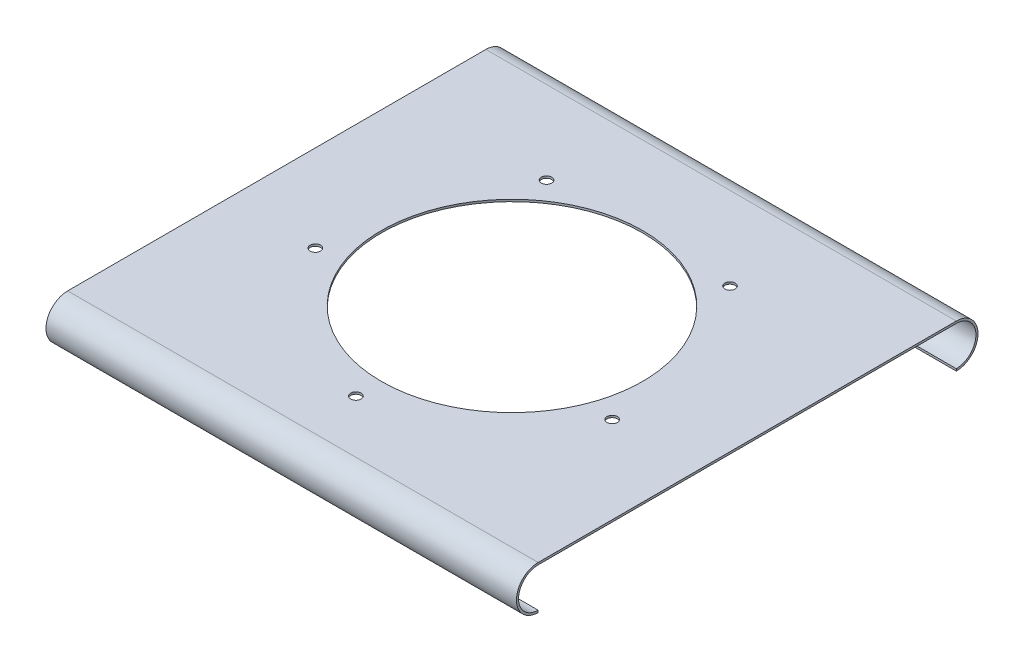
ISO-10303-21;
HEADER;
FILE_DESCRIPTION(('STEP AP214'),'2;1');
FILE_NAME('part.step','',(''),(''),'','','');
FILE_SCHEMA(('AUTOMOTIVE_DESIGN { 1 0 10303 214 1 1 1 1 }'));
ENDSEC;
DATA;
#1=APPLICATION_CONTEXT('core data for automotive mechanical design processes');
#2=APPLICATION_PROTOCOL_DEFINITION('international standard','automotive_design',2000,#1);
#3=PRODUCT_CONTEXT('',#1,'mechanical');
#4=PRODUCT('Part','Part','',(#3));
#5=PRODUCT_RELATED_PRODUCT_CATEGORY('part','',(#4));
#6=PRODUCT_DEFINITION_FORMATION('','',#4);
#7=PRODUCT_DEFINITION_CONTEXT('part definition',#1,'design');
#8=PRODUCT_DEFINITION('design','',#6,#7);
#9=PRODUCT_DEFINITION_SHAPE('','',#8);
#10=(LENGTH_UNIT() NAMED_UNIT(*) SI_UNIT(.MILLI.,.METRE.));
#11=(NAMED_UNIT(*) PLANE_ANGLE_UNIT() SI_UNIT($,.RADIAN.));
#12=(NAMED_UNIT(*) SI_UNIT($,.STERADIAN.) SOLID_ANGLE_UNIT());
#13=UNCERTAINTY_MEASURE_WITH_UNIT(LENGTH_MEASURE(1.E-05),#10,'distance_accuracy_value','');
#14=(GEOMETRIC_REPRESENTATION_CONTEXT(3) GLOBAL_UNCERTAINTY_ASSIGNED_CONTEXT((#13)) GLOBAL_UNIT_ASSIGNED_CONTEXT((#10,
#11,#12)) REPRESENTATION_CONTEXT('',''));
#15=CARTESIAN_POINT('',(0.,0.,0.));
#16=DIRECTION('',(0.,0.,1.));
#17=DIRECTION('',(1.,0.,0.));
#18=AXIS2_PLACEMENT_3D('',#15,#16,#17);
#19=CARTESIAN_POINT('',(114.3,228.6,101.6));
#20=DIRECTION('',(-1.,0.,0.));
#21=DIRECTION('',(0.,0.,1.));
#22=AXIS2_PLACEMENT_3D('',#19,#20,#21);
#23=CYLINDRICAL_SURFACE('',#22,9.52499999999995);
#24=CARTESIAN_POINT('',(-114.3,228.6,101.6));
#25=DIRECTION('',(-1.,0.,0.));
#26=DIRECTION('',(0.,0.,-1.));
#27=AXIS2_PLACEMENT_3D('',#24,#25,#26);
#28=CIRCLE('',#27,9.52499999999995);
#29=CARTESIAN_POINT('',(-114.3,219.075,101.6));
#30=VERTEX_POINT('',#29);
#31=CARTESIAN_POINT('',(-114.3,238.125,101.6));
#32=VERTEX_POINT('',#31);
#33=EDGE_CURVE('E129',#30,#32,#28,.T.);
#34=ORIENTED_EDGE('',*,*,#33,.T.);
#35=DIRECTION('',(-1.,0.,0.));
#36=VECTOR('',#35,1.);
#37=CARTESIAN_POINT('',(114.3,238.125,101.6));
#38=LINE('',#37,#36);
#39=CARTESIAN_POINT('',(114.3,238.125,101.6));
#40=VERTEX_POINT('',#39);
#41=EDGE_CURVE('E11',#40,#32,#38,.T.);
#42=ORIENTED_EDGE('',*,*,#41,.F.);
#43=CARTESIAN_POINT('',(114.3,228.6,101.6));
#44=DIRECTION('',(-1.,0.,0.));
#45=DIRECTION('',(0.,0.,-1.));
#46=AXIS2_PLACEMENT_3D('',#43,#44,#45);
#47=CIRCLE('',#46,9.52499999999995);
#48=CARTESIAN_POINT('',(114.3,219.075,101.6));
#49=VERTEX_POINT('',#48);
#50=EDGE_CURVE('E144',#49,#40,#47,.T.);
#51=ORIENTED_EDGE('',*,*,#50,.F.);
#52=DIRECTION('',(-1.,0.,0.));
#53=VECTOR('',#52,1.);
#54=CARTESIAN_POINT('',(114.3,219.075,101.6));
#55=LINE('',#54,#53);
#56=EDGE_CURVE('E125',#49,#30,#55,.T.);
#57=ORIENTED_EDGE('',*,*,#56,.T.);
#58=EDGE_LOOP('',(#34,#42,#51,#57));
#59=FACE_BOUND('',#58,.T.);
#60=ADVANCED_FACE('F33',(#59),#23,.F.);
#61=CARTESIAN_POINT('',(114.3,238.125,101.6));
#62=DIRECTION('',(0.,1.,0.));
#63=DIRECTION('',(0.,0.,1.));
#64=AXIS2_PLACEMENT_3D('',#61,#62,#63);
#65=PLANE('',#64);
#66=CARTESIAN_POINT('',(0.,238.125,75.8374533940751));
#67=DIRECTION('',(0.,1.,0.));
#68=DIRECTION('',(0.,0.,1.));
#69=AXIS2_PLACEMENT_3D('',#66,#67,#68);
#70=CIRCLE('',#69,2.522855);
#71=CARTESIAN_POINT('',(0.,238.125,78.3603083940751));
#72=VERTEX_POINT('',#71);
#73=EDGE_CURVE('E182',#72,#72,#70,.F.);
#74=ORIENTED_EDGE('',*,*,#73,.F.);
#75=EDGE_LOOP('',(#74));
#76=FACE_BOUND('',#75,.T.);
#77=CARTESIAN_POINT('',(-72.1257042296652,238.125,23.435061908887));
#78=DIRECTION('',(0.,1.,0.));
#79=DIRECTION('',(0.,0.,1.));
#80=AXIS2_PLACEMENT_3D('',#77,#78,#79);
#81=CIRCLE('',#80,2.52285500000001);
#82=CARTESIAN_POINT('',(-72.1257042296652,238.125,25.957916908887));
#83=VERTEX_POINT('',#82);
#84=EDGE_CURVE('E202',#83,#83,#81,.F.);
#85=ORIENTED_EDGE('',*,*,#84,.F.);
#86=EDGE_LOOP('',(#85));
#87=FACE_BOUND('',#86,.T.);
#88=CARTESIAN_POINT('',(-44.5761366764548,238.125,-61.3537886059251));
#89=DIRECTION('',(0.,1.,0.));
#90=DIRECTION('',(0.,0.,1.));
#91=AXIS2_PLACEMENT_3D('',#88,#89,#90);
#92=CIRCLE('',#91,2.522855);
#93=CARTESIAN_POINT('',(-44.5761366764548,238.125,-58.8309336059251));
#94=VERTEX_POINT('',#93);
#95=EDGE_CURVE('E196',#94,#94,#92,.F.);
#96=ORIENTED_EDGE('',*,*,#95,.F.);
#97=EDGE_LOOP('',(#96));
#98=FACE_BOUND('',#97,.T.);
#99=CARTESIAN_POINT('',(44.5761366764556,238.125,-61.3537886059244));
#100=DIRECTION('',(0.,1.,0.));
#101=DIRECTION('',(0.,0.,1.));
#102=AXIS2_PLACEMENT_3D('',#99,#100,#101);
#103=CIRCLE('',#102,2.522855);
#104=CARTESIAN_POINT('',(44.5761366764556,238.125,-58.8309336059244));
#105=VERTEX_POINT('',#104);
#106=EDGE_CURVE('E190',#105,#105,#103,.F.);
#107=ORIENTED_EDGE('',*,*,#106,.F.);
#108=EDGE_LOOP('',(#107));
#109=FACE_BOUND('',#108,.T.);
#110=CARTESIAN_POINT('',(72.1257042296652,238.125,23.4350619088872));
#111=DIRECTION('',(0.,1.,0.));
#112=DIRECTION('',(0.,0.,1.));
#113=AXIS2_PLACEMENT_3D('',#110,#111,#112);
#114=CIRCLE('',#113,2.52285499999915);
#115=CARTESIAN_POINT('',(72.1257042296652,238.125,25.9579169088863));
#116=VERTEX_POINT('',#115);
#117=EDGE_CURVE('E183',#116,#116,#114,.F.);
#118=ORIENTED_EDGE('',*,*,#117,.F.);
#119=EDGE_LOOP('',(#118));
#120=FACE_BOUND('',#119,.T.);
#121=CARTESIAN_POINT('',(0.,238.125,0.));
#122=DIRECTION('',(0.,1.,0.));
#123=DIRECTION('',(0.,0.,1.));
#124=AXIS2_PLACEMENT_3D('',#121,#122,#123);
#125=CIRCLE('',#124,63.5);
#126=CARTESIAN_POINT('',(0.,238.125,63.5));
#127=VERTEX_POINT('',#126);
#128=EDGE_CURVE('E133',#127,#127,#125,.F.);
#129=ORIENTED_EDGE('',*,*,#128,.F.);
#130=EDGE_LOOP('',(#129));
#131=FACE_BOUND('',#130,.T.);
#132=DIRECTION('',(0.,0.,-1.));
#133=VECTOR('',#132,1.);
#134=CARTESIAN_POINT('',(-114.3,238.125,101.6));
#135=LINE('',#134,#133);
#136=CARTESIAN_POINT('',(-114.3,238.125,-101.6));
#137=VERTEX_POINT('',#136);
#138=EDGE_CURVE('E132',#32,#137,#135,.T.);
#139=ORIENTED_EDGE('',*,*,#138,.T.);
#140=DIRECTION('',(-1.,0.,0.));
#141=VECTOR('',#140,1.);
#142=CARTESIAN_POINT('',(114.3,238.125,-101.6));
#143=LINE('',#142,#141);
#144=CARTESIAN_POINT('',(114.3,238.125,-101.6));
#145=VERTEX_POINT('',#144);
#146=EDGE_CURVE('E41',#145,#137,#143,.T.);
#147=ORIENTED_EDGE('',*,*,#146,.F.);
#148=DIRECTION('',(0.,0.,-1.));
#149=VECTOR('',#148,1.);
#150=CARTESIAN_POINT('',(114.3,238.125,101.6));
#151=LINE('',#150,#149);
#152=EDGE_CURVE('E92',#40,#145,#151,.T.);
#153=ORIENTED_EDGE('',*,*,#152,.F.);
#154=ORIENTED_EDGE('',*,*,#41,.T.);
#155=EDGE_LOOP('',(#139,#147,#153,#154));
#156=FACE_BOUND('',#155,.T.);
#157=ADVANCED_FACE('F243',(#76,#87,#98,#109,#120,#131,#156),#65,.F.);
#158=CARTESIAN_POINT('',(114.3,228.6,-101.6));
#159=DIRECTION('',(-1.,0.,0.));
#160=DIRECTION('',(0.,0.,1.));
#161=AXIS2_PLACEMENT_3D('',#158,#159,#160);
#162=CYLINDRICAL_SURFACE('',#161,9.52499999999996);
#163=CARTESIAN_POINT('',(-114.3,228.6,-101.6));
#164=DIRECTION('',(-1.,0.,0.));
#165=DIRECTION('',(0.,0.,1.));
#166=AXIS2_PLACEMENT_3D('',#163,#164,#165);
#167=CIRCLE('',#166,9.52499999999996);
#168=CARTESIAN_POINT('',(-114.3,219.075,-101.6));
#169=VERTEX_POINT('',#168);
#170=EDGE_CURVE('E135',#137,#169,#167,.T.);
#171=ORIENTED_EDGE('',*,*,#170,.T.);
#172=DIRECTION('',(-1.,0.,0.));
#173=VECTOR('',#172,1.);
#174=CARTESIAN_POINT('',(114.3,219.075,-101.6));
#175=LINE('',#174,#173);
#176=CARTESIAN_POINT('',(114.3,219.075,-101.6));
#177=VERTEX_POINT('',#176);
#178=EDGE_CURVE('E151',#177,#169,#175,.T.);
#179=ORIENTED_EDGE('',*,*,#178,.F.);
#180=CARTESIAN_POINT('',(114.3,228.6,-101.6));
#181=DIRECTION('',(-1.,0.,0.));
#182=DIRECTION('',(0.,0.,1.));
#183=AXIS2_PLACEMENT_3D('',#180,#181,#182);
#184=CIRCLE('',#183,9.52499999999996);
#185=EDGE_CURVE('E159',#145,#177,#184,.T.);
#186=ORIENTED_EDGE('',*,*,#185,.F.);
#187=ORIENTED_EDGE('',*,*,#146,.T.);
#188=EDGE_LOOP('',(#171,#179,#186,#187));
#189=FACE_BOUND('',#188,.T.);
#190=ADVANCED_FACE('F157',(#189),#162,.F.);
#191=CARTESIAN_POINT('',(114.3,218.059,-101.6));
#192=DIRECTION('',(0.,0.,-1.));
#193=DIRECTION('',(-1.,0.,0.));
#194=AXIS2_PLACEMENT_3D('',#191,#192,#193);
#195=PLANE('',#194);
#196=DIRECTION('',(0.,-1.,0.));
#197=VECTOR('',#196,1.);
#198=CARTESIAN_POINT('',(-114.3,218.059,-101.6));
#199=LINE('',#198,#197);
#200=CARTESIAN_POINT('',(-114.3,218.059,-101.6));
#201=VERTEX_POINT('',#200);
#202=EDGE_CURVE('E137',#169,#201,#199,.T.);
#203=ORIENTED_EDGE('',*,*,#202,.T.);
#204=DIRECTION('',(-1.,0.,0.));
#205=VECTOR('',#204,1.);
#206=CARTESIAN_POINT('',(114.3,218.059,-101.6));
#207=LINE('',#206,#205);
#208=CARTESIAN_POINT('',(114.3,218.059,-101.6));
#209=VERTEX_POINT('',#208);
#210=EDGE_CURVE('E148',#209,#201,#207,.T.);
#211=ORIENTED_EDGE('',*,*,#210,.F.);
#212=DIRECTION('',(0.,-1.,0.));
#213=VECTOR('',#212,1.);
#214=CARTESIAN_POINT('',(114.3,218.059,-101.6));
#215=LINE('',#214,#213);
#216=EDGE_CURVE('E171',#177,#209,#215,.T.);
#217=ORIENTED_EDGE('',*,*,#216,.F.);
#218=ORIENTED_EDGE('',*,*,#178,.T.);
#219=EDGE_LOOP('',(#203,#211,#217,#218));
#220=FACE_BOUND('',#219,.T.);
#221=ADVANCED_FACE('F167',(#220),#195,.F.);
#222=CARTESIAN_POINT('',(114.3,228.6,-101.6));
#223=DIRECTION('',(-1.,0.,0.));
#224=DIRECTION('',(0.,0.,1.));
#225=AXIS2_PLACEMENT_3D('',#222,#223,#224);
#226=CYLINDRICAL_SURFACE('',#225,10.541);
#227=CARTESIAN_POINT('',(-114.3,228.6,-101.6));
#228=DIRECTION('',(1.,0.,0.));
#229=DIRECTION('',(0.,0.,1.));
#230=AXIS2_PLACEMENT_3D('',#227,#228,#229);
#231=CIRCLE('',#230,10.541);
#232=CARTESIAN_POINT('',(-114.3,239.141,-101.6));
#233=VERTEX_POINT('',#232);
#234=EDGE_CURVE('E139',#201,#233,#231,.T.);
#235=ORIENTED_EDGE('',*,*,#234,.T.);
#236=DIRECTION('',(-1.,0.,0.));
#237=VECTOR('',#236,1.);
#238=CARTESIAN_POINT('',(114.3,239.141,-101.6));
#239=LINE('',#238,#237);
#240=CARTESIAN_POINT('',(114.3,239.141,-101.6));
#241=VERTEX_POINT('',#240);
#242=EDGE_CURVE('E120',#241,#233,#239,.T.);
#243=ORIENTED_EDGE('',*,*,#242,.F.);
#244=CARTESIAN_POINT('',(114.3,228.6,-101.6));
#245=DIRECTION('',(1.,0.,0.));
#246=DIRECTION('',(0.,0.,1.));
#247=AXIS2_PLACEMENT_3D('',#244,#245,#246);
#248=CIRCLE('',#247,10.541);
#249=EDGE_CURVE('E111',#209,#241,#248,.T.);
#250=ORIENTED_EDGE('',*,*,#249,.F.);
#251=ORIENTED_EDGE('',*,*,#210,.T.);
#252=EDGE_LOOP('',(#235,#243,#250,#251));
#253=FACE_BOUND('',#252,.T.);
#254=ADVANCED_FACE('F170',(#253),#226,.T.);
#255=CARTESIAN_POINT('',(114.3,239.141,101.6));
#256=DIRECTION('',(0.,-1.,0.));
#257=DIRECTION('',(0.,0.,-1.));
#258=AXIS2_PLACEMENT_3D('',#255,#256,#257);
#259=PLANE('',#258);
#260=CARTESIAN_POINT('',(0.,239.141,75.8374533940751));
#261=DIRECTION('',(0.,1.,0.));
#262=DIRECTION('',(0.,0.,1.));
#263=AXIS2_PLACEMENT_3D('',#260,#261,#262);
#264=CIRCLE('',#263,2.522855);
#265=CARTESIAN_POINT('',(0.,239.141,78.3603083940751));
#266=VERTEX_POINT('',#265);
#267=EDGE_CURVE('E205',#266,#266,#264,.T.);
#268=ORIENTED_EDGE('',*,*,#267,.F.);
#269=EDGE_LOOP('',(#268));
#270=FACE_BOUND('',#269,.T.);
#271=CARTESIAN_POINT('',(-72.1257042296652,239.141,23.435061908887));
#272=DIRECTION('',(0.,1.,0.));
#273=DIRECTION('',(0.,0.,1.));
#274=AXIS2_PLACEMENT_3D('',#271,#272,#273);
#275=CIRCLE('',#274,2.52285500000001);
#276=CARTESIAN_POINT('',(-72.1257042296652,239.141,25.957916908887));
#277=VERTEX_POINT('',#276);
#278=EDGE_CURVE('E199',#277,#277,#275,.T.);
#279=ORIENTED_EDGE('',*,*,#278,.F.);
#280=EDGE_LOOP('',(#279));
#281=FACE_BOUND('',#280,.T.);
#282=CARTESIAN_POINT('',(-44.5761366764548,239.141,-61.3537886059251));
#283=DIRECTION('',(0.,1.,0.));
#284=DIRECTION('',(0.,0.,1.));
#285=AXIS2_PLACEMENT_3D('',#282,#283,#284);
#286=CIRCLE('',#285,2.522855);
#287=CARTESIAN_POINT('',(-44.5761366764548,239.141,-58.8309336059251));
#288=VERTEX_POINT('',#287);
#289=EDGE_CURVE('E193',#288,#288,#286,.T.);
#290=ORIENTED_EDGE('',*,*,#289,.F.);
#291=EDGE_LOOP('',(#290));
#292=FACE_BOUND('',#291,.T.);
#293=CARTESIAN_POINT('',(44.5761366764556,239.141,-61.3537886059244));
#294=DIRECTION('',(0.,1.,0.));
#295=DIRECTION('',(0.,0.,1.));
#296=AXIS2_PLACEMENT_3D('',#293,#294,#295);
#297=CIRCLE('',#296,2.522855);
#298=CARTESIAN_POINT('',(44.5761366764556,239.141,-58.8309336059244));
#299=VERTEX_POINT('',#298);
#300=EDGE_CURVE('E186',#299,#299,#297,.T.);
#301=ORIENTED_EDGE('',*,*,#300,.F.);
#302=EDGE_LOOP('',(#301));
#303=FACE_BOUND('',#302,.T.);
#304=CARTESIAN_POINT('',(72.1257042296652,239.141,23.4350619088872));
#305=DIRECTION('',(0.,1.,0.));
#306=DIRECTION('',(0.,0.,1.));
#307=AXIS2_PLACEMENT_3D('',#304,#305,#306);
#308=CIRCLE('',#307,2.52285499999915);
#309=CARTESIAN_POINT('',(72.1257042296652,239.141,25.9579169088863));
#310=VERTEX_POINT('',#309);
#311=EDGE_CURVE('E187',#310,#310,#308,.T.);
#312=ORIENTED_EDGE('',*,*,#311,.F.);
#313=EDGE_LOOP('',(#312));
#314=FACE_BOUND('',#313,.T.);
#315=CARTESIAN_POINT('',(0.,239.141,0.));
#316=DIRECTION('',(0.,1.,0.));
#317=DIRECTION('',(0.,0.,1.));
#318=AXIS2_PLACEMENT_3D('',#315,#316,#317);
#319=CIRCLE('',#318,63.5);
#320=CARTESIAN_POINT('',(0.,239.141,63.5));
#321=VERTEX_POINT('',#320);
#322=EDGE_CURVE('E179',#321,#321,#319,.T.);
#323=ORIENTED_EDGE('',*,*,#322,.F.);
#324=EDGE_LOOP('',(#323));
#325=FACE_BOUND('',#324,.T.);
#326=DIRECTION('',(0.,0.,1.));
#327=VECTOR('',#326,1.);
#328=CARTESIAN_POINT('',(-114.3,239.141,101.6));
#329=LINE('',#328,#327);
#330=CARTESIAN_POINT('',(-114.3,239.141,101.6));
#331=VERTEX_POINT('',#330);
#332=EDGE_CURVE('E119',#233,#331,#329,.T.);
#333=ORIENTED_EDGE('',*,*,#332,.T.);
#334=DIRECTION('',(-1.,0.,0.));
#335=VECTOR('',#334,1.);
#336=CARTESIAN_POINT('',(114.3,239.141,101.6));
#337=LINE('',#336,#335);
#338=CARTESIAN_POINT('',(114.3,239.141,101.6));
#339=VERTEX_POINT('',#338);
#340=EDGE_CURVE('E116',#339,#331,#337,.T.);
#341=ORIENTED_EDGE('',*,*,#340,.F.);
#342=DIRECTION('',(0.,0.,1.));
#343=VECTOR('',#342,1.);
#344=CARTESIAN_POINT('',(114.3,239.141,101.6));
#345=LINE('',#344,#343);
#346=EDGE_CURVE('E105',#241,#339,#345,.T.);
#347=ORIENTED_EDGE('',*,*,#346,.F.);
#348=ORIENTED_EDGE('',*,*,#242,.T.);
#349=EDGE_LOOP('',(#333,#341,#347,#348));
#350=FACE_BOUND('',#349,.T.);
#351=ADVANCED_FACE('F117',(#270,#281,#292,#303,#314,#325,#350),#259,.F.);
#352=CARTESIAN_POINT('',(114.3,228.6,101.6));
#353=DIRECTION('',(-1.,0.,0.));
#354=DIRECTION('',(0.,0.,1.));
#355=AXIS2_PLACEMENT_3D('',#352,#353,#354);
#356=CYLINDRICAL_SURFACE('',#355,10.541);
#357=CARTESIAN_POINT('',(-114.3,228.6,101.6));
#358=DIRECTION('',(1.,0.,0.));
#359=DIRECTION('',(0.,0.,-1.));
#360=AXIS2_PLACEMENT_3D('',#357,#358,#359);
#361=CIRCLE('',#360,10.541);
#362=CARTESIAN_POINT('',(-114.3,218.059,101.6));
#363=VERTEX_POINT('',#362);
#364=EDGE_CURVE('E78',#331,#363,#361,.T.);
#365=ORIENTED_EDGE('',*,*,#364,.T.);
#366=DIRECTION('',(-1.,0.,0.));
#367=VECTOR('',#366,1.);
#368=CARTESIAN_POINT('',(114.3,218.059,101.6));
#369=LINE('',#368,#367);
#370=CARTESIAN_POINT('',(114.3,218.059,101.6));
#371=VERTEX_POINT('',#370);
#372=EDGE_CURVE('E121',#371,#363,#369,.T.);
#373=ORIENTED_EDGE('',*,*,#372,.F.);
#374=CARTESIAN_POINT('',(114.3,228.6,101.6));
#375=DIRECTION('',(1.,0.,0.));
#376=DIRECTION('',(0.,0.,-1.));
#377=AXIS2_PLACEMENT_3D('',#374,#375,#376);
#378=CIRCLE('',#377,10.541);
#379=EDGE_CURVE('E109',#339,#371,#378,.T.);
#380=ORIENTED_EDGE('',*,*,#379,.F.);
#381=ORIENTED_EDGE('',*,*,#340,.T.);
#382=EDGE_LOOP('',(#365,#373,#380,#381));
#383=FACE_BOUND('',#382,.T.);
#384=ADVANCED_FACE('F123',(#383),#356,.T.);
#385=CARTESIAN_POINT('',(114.3,218.059,101.6));
#386=DIRECTION('',(0.,0.,1.));
#387=DIRECTION('',(0.,-1.,0.));
#388=AXIS2_PLACEMENT_3D('',#385,#386,#387);
#389=PLANE('',#388);
#390=DIRECTION('',(0.,1.,0.));
#391=VECTOR('',#390,1.);
#392=CARTESIAN_POINT('',(-114.3,218.059,101.6));
#393=LINE('',#392,#391);
#394=EDGE_CURVE('E84',#363,#30,#393,.T.);
#395=ORIENTED_EDGE('',*,*,#394,.T.);
#396=ORIENTED_EDGE('',*,*,#56,.F.);
#397=DIRECTION('',(0.,1.,0.));
#398=VECTOR('',#397,1.);
#399=CARTESIAN_POINT('',(114.3,218.059,101.6));
#400=LINE('',#399,#398);
#401=EDGE_CURVE('E49',#371,#49,#400,.T.);
#402=ORIENTED_EDGE('',*,*,#401,.F.);
#403=ORIENTED_EDGE('',*,*,#372,.T.);
#404=EDGE_LOOP('',(#395,#396,#402,#403));
#405=FACE_BOUND('',#404,.T.);
#406=ADVANCED_FACE('F251',(#405),#389,.F.);
#407=CARTESIAN_POINT('',(114.3,228.6,101.6));
#408=DIRECTION('',(1.,0.,0.));
#409=DIRECTION('',(0.,0.,-1.));
#410=AXIS2_PLACEMENT_3D('',#407,#408,#409);
#411=PLANE('',#410);
#412=ORIENTED_EDGE('',*,*,#50,.T.);
#413=ORIENTED_EDGE('',*,*,#152,.T.);
#414=ORIENTED_EDGE('',*,*,#185,.T.);
#415=ORIENTED_EDGE('',*,*,#216,.T.);
#416=ORIENTED_EDGE('',*,*,#249,.T.);
#417=ORIENTED_EDGE('',*,*,#346,.T.);
#418=ORIENTED_EDGE('',*,*,#379,.T.);
#419=ORIENTED_EDGE('',*,*,#401,.T.);
#420=EDGE_LOOP('',(#412,#413,#414,#415,#416,#417,#418,#419));
#421=FACE_BOUND('',#420,.T.);
#422=ADVANCED_FACE('F107',(#421),#411,.T.);
#423=CARTESIAN_POINT('',(-114.3,228.6,101.6));
#424=DIRECTION('',(1.,0.,0.));
#425=DIRECTION('',(0.,0.,-1.));
#426=AXIS2_PLACEMENT_3D('',#423,#424,#425);
#427=PLANE('',#426);
#428=ORIENTED_EDGE('',*,*,#33,.F.);
#429=ORIENTED_EDGE('',*,*,#394,.F.);
#430=ORIENTED_EDGE('',*,*,#364,.F.);
#431=ORIENTED_EDGE('',*,*,#332,.F.);
#432=ORIENTED_EDGE('',*,*,#234,.F.);
#433=ORIENTED_EDGE('',*,*,#202,.F.);
#434=ORIENTED_EDGE('',*,*,#170,.F.);
#435=ORIENTED_EDGE('',*,*,#138,.F.);
#436=EDGE_LOOP('',(#428,#429,#430,#431,#432,#433,#434,#435));
#437=FACE_BOUND('',#436,.T.);
#438=ADVANCED_FACE('F163',(#437),#427,.F.);
#439=CARTESIAN_POINT('',(0.,58.5198775786169,0.));
#440=DIRECTION('',(0.,1.,0.));
#441=DIRECTION('',(0.,0.,1.));
#442=AXIS2_PLACEMENT_3D('',#439,#440,#441);
#443=CYLINDRICAL_SURFACE('',#442,63.5);
#444=ORIENTED_EDGE('',*,*,#128,.T.);
#445=EDGE_LOOP('',(#444));
#446=FACE_BOUND('',#445,.T.);
#447=ORIENTED_EDGE('',*,*,#322,.T.);
#448=EDGE_LOOP('',(#447));
#449=FACE_BOUND('',#448,.T.);
#450=ADVANCED_FACE('F228',(#446,#449),#443,.F.);
#451=CARTESIAN_POINT('',(72.1257042296652,230.989288486198,23.4350619088872));
#452=DIRECTION('',(0.,1.,0.));
#453=DIRECTION('',(0.,0.,1.));
#454=AXIS2_PLACEMENT_3D('',#451,#452,#453);
#455=CYLINDRICAL_SURFACE('',#454,2.52285499999915);
#456=ORIENTED_EDGE('',*,*,#117,.T.);
#457=EDGE_LOOP('',(#456));
#458=FACE_BOUND('',#457,.T.);
#459=ORIENTED_EDGE('',*,*,#311,.T.);
#460=EDGE_LOOP('',(#459));
#461=FACE_BOUND('',#460,.T.);
#462=ADVANCED_FACE('F230',(#458,#461),#455,.F.);
#463=CARTESIAN_POINT('',(44.5761366764556,230.989288486198,-61.3537886059244));
#464=DIRECTION('',(0.,1.,0.));
#465=DIRECTION('',(0.,0.,1.));
#466=AXIS2_PLACEMENT_3D('',#463,#464,#465);
#467=CYLINDRICAL_SURFACE('',#466,2.522855);
#468=ORIENTED_EDGE('',*,*,#106,.T.);
#469=EDGE_LOOP('',(#468));
#470=FACE_BOUND('',#469,.T.);
#471=ORIENTED_EDGE('',*,*,#300,.T.);
#472=EDGE_LOOP('',(#471));
#473=FACE_BOUND('',#472,.T.);
#474=ADVANCED_FACE('F237',(#470,#473),#467,.F.);
#475=CARTESIAN_POINT('',(-44.5761366764548,230.989288486198,-61.3537886059251));
#476=DIRECTION('',(0.,1.,0.));
#477=DIRECTION('',(0.,0.,1.));
#478=AXIS2_PLACEMENT_3D('',#475,#476,#477);
#479=CYLINDRICAL_SURFACE('',#478,2.522855);
#480=ORIENTED_EDGE('',*,*,#95,.T.);
#481=EDGE_LOOP('',(#480));
#482=FACE_BOUND('',#481,.T.);
#483=ORIENTED_EDGE('',*,*,#289,.T.);
#484=EDGE_LOOP('',(#483));
#485=FACE_BOUND('',#484,.T.);
#486=ADVANCED_FACE('F327',(#482,#485),#479,.F.);
#487=CARTESIAN_POINT('',(-72.1257042296652,230.989288486198,23.435061908887));
#488=DIRECTION('',(0.,1.,0.));
#489=DIRECTION('',(0.,0.,1.));
#490=AXIS2_PLACEMENT_3D('',#487,#488,#489);
#491=CYLINDRICAL_SURFACE('',#490,2.52285500000001);
#492=ORIENTED_EDGE('',*,*,#84,.T.);
#493=EDGE_LOOP('',(#492));
#494=FACE_BOUND('',#493,.T.);
#495=ORIENTED_EDGE('',*,*,#278,.T.);
#496=EDGE_LOOP('',(#495));
#497=FACE_BOUND('',#496,.T.);
#498=ADVANCED_FACE('F337',(#494,#497),#491,.F.);
#499=CARTESIAN_POINT('',(0.,230.989288486198,75.8374533940751));
#500=DIRECTION('',(0.,1.,0.));
#501=DIRECTION('',(0.,0.,1.));
#502=AXIS2_PLACEMENT_3D('',#499,#500,#501);
#503=CYLINDRICAL_SURFACE('',#502,2.522855);
#504=ORIENTED_EDGE('',*,*,#73,.T.);
#505=EDGE_LOOP('',(#504));
#506=FACE_BOUND('',#505,.T.);
#507=ORIENTED_EDGE('',*,*,#267,.T.);
#508=EDGE_LOOP('',(#507));
#509=FACE_BOUND('',#508,.T.);
#510=ADVANCED_FACE('F213',(#506,#509),#503,.F.);
#511=CLOSED_SHELL('',(#60,#157,#190,#221,#254,#351,#384,#406,#422,#438,#450,#462,#474,#486,#498,#510));
#512=MANIFOLD_SOLID_BREP('B2',#511);
#513=ADVANCED_BREP_SHAPE_REPRESENTATION('',(#18,#512),#14);
#514=SHAPE_DEFINITION_REPRESENTATION(#9,#513);
ENDSEC;
END-ISO-10303-21;
